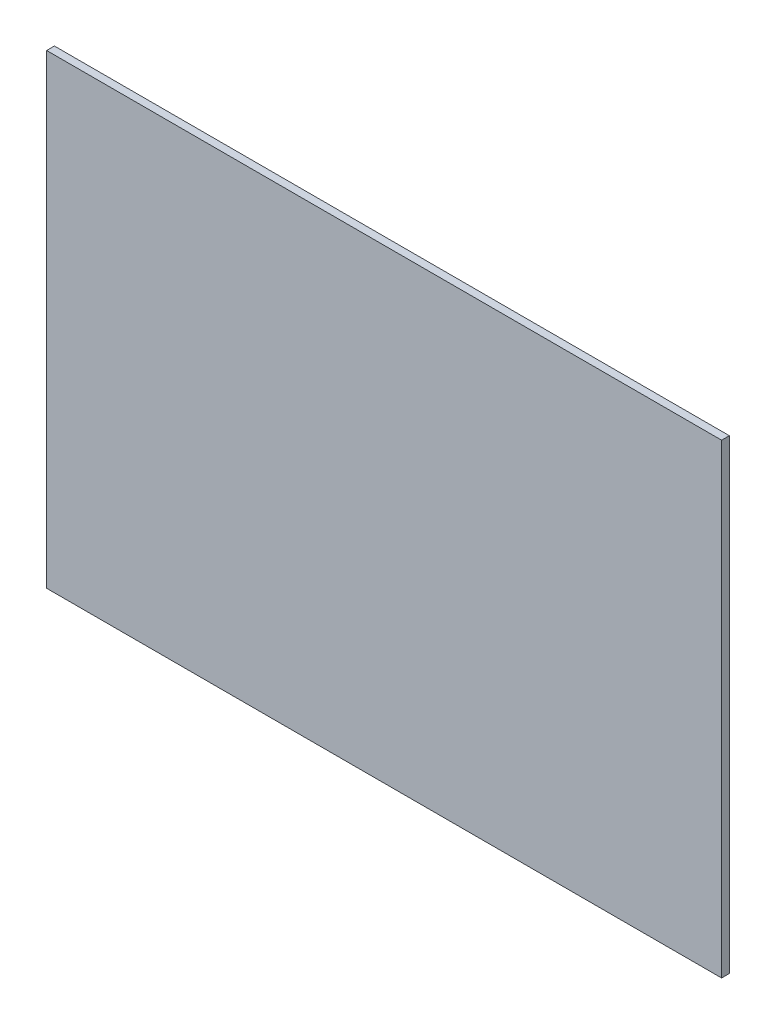
ISO-10303-21;
HEADER;
FILE_DESCRIPTION(('STEP AP214'),'2;1');
FILE_NAME('part.step','',(''),(''),'','','');
FILE_SCHEMA(('AUTOMOTIVE_DESIGN { 1 0 10303 214 1 1 1 1 }'));
ENDSEC;
DATA;
#1=APPLICATION_CONTEXT('core data for automotive mechanical design processes');
#2=APPLICATION_PROTOCOL_DEFINITION('international standard','automotive_design',2000,#1);
#3=PRODUCT_CONTEXT('',#1,'mechanical');
#4=PRODUCT('Part','Part','',(#3));
#5=PRODUCT_RELATED_PRODUCT_CATEGORY('part','',(#4));
#6=PRODUCT_DEFINITION_FORMATION('','',#4);
#7=PRODUCT_DEFINITION_CONTEXT('part definition',#1,'design');
#8=PRODUCT_DEFINITION('design','',#6,#7);
#9=PRODUCT_DEFINITION_SHAPE('','',#8);
#10=(LENGTH_UNIT() NAMED_UNIT(*) SI_UNIT(.MILLI.,.METRE.));
#11=(NAMED_UNIT(*) PLANE_ANGLE_UNIT() SI_UNIT($,.RADIAN.));
#12=(NAMED_UNIT(*) SI_UNIT($,.STERADIAN.) SOLID_ANGLE_UNIT());
#13=UNCERTAINTY_MEASURE_WITH_UNIT(LENGTH_MEASURE(1.E-05),#10,'distance_accuracy_value','');
#14=(GEOMETRIC_REPRESENTATION_CONTEXT(3) GLOBAL_UNCERTAINTY_ASSIGNED_CONTEXT((#13)) GLOBAL_UNIT_ASSIGNED_CONTEXT((#10,
#11,#12)) REPRESENTATION_CONTEXT('',''));
#15=CARTESIAN_POINT('',(0.,0.,0.));
#16=DIRECTION('',(0.,0.,1.));
#17=DIRECTION('',(1.,0.,0.));
#18=AXIS2_PLACEMENT_3D('',#15,#16,#17);
#19=CARTESIAN_POINT('',(-0.6025,0.,0.));
#20=DIRECTION('',(0.,0.,1.));
#21=DIRECTION('',(1.,0.,0.));
#22=AXIS2_PLACEMENT_3D('',#19,#20,#21);
#23=PLANE('',#22);
#24=DIRECTION('',(1.,0.,0.));
#25=VECTOR('',#24,1.);
#26=CARTESIAN_POINT('',(3.745,3.,0.));
#27=LINE('',#26,#25);
#28=CARTESIAN_POINT('',(3.745,3.,0.));
#29=VERTEX_POINT('',#28);
#30=CARTESIAN_POINT('',(-4.95,3.,0.));
#31=VERTEX_POINT('',#30);
#32=EDGE_CURVE('E78',#29,#31,#27,.F.);
#33=ORIENTED_EDGE('',*,*,#32,.F.);
#34=DIRECTION('',(0.,1.,0.));
#35=VECTOR('',#34,1.);
#36=CARTESIAN_POINT('',(3.745,-3.,0.));
#37=LINE('',#36,#35);
#38=CARTESIAN_POINT('',(3.745,-3.,0.));
#39=VERTEX_POINT('',#38);
#40=EDGE_CURVE('E54',#39,#29,#37,.T.);
#41=ORIENTED_EDGE('',*,*,#40,.F.);
#42=DIRECTION('',(1.,0.,0.));
#43=VECTOR('',#42,1.);
#44=CARTESIAN_POINT('',(-4.95,-3.,0.));
#45=LINE('',#44,#43);
#46=CARTESIAN_POINT('',(-4.95,-3.,0.));
#47=VERTEX_POINT('',#46);
#48=EDGE_CURVE('E56',#47,#39,#45,.T.);
#49=ORIENTED_EDGE('',*,*,#48,.F.);
#50=DIRECTION('',(0.,-1.,0.));
#51=VECTOR('',#50,1.);
#52=CARTESIAN_POINT('',(-4.95,3.,0.));
#53=LINE('',#52,#51);
#54=EDGE_CURVE('E19',#31,#47,#53,.T.);
#55=ORIENTED_EDGE('',*,*,#54,.F.);
#56=EDGE_LOOP('',(#33,#41,#49,#55));
#57=FACE_BOUND('',#56,.T.);
#58=ADVANCED_FACE('F16',(#57),#23,.F.);
#59=CARTESIAN_POINT('',(-4.95,3.,0.));
#60=DIRECTION('',(-1.,0.,0.));
#61=DIRECTION('',(0.,-1.,0.));
#62=AXIS2_PLACEMENT_3D('',#59,#60,#61);
#63=PLANE('',#62);
#64=DIRECTION('',(0.,1.,0.));
#65=VECTOR('',#64,1.);
#66=CARTESIAN_POINT('',(-4.95,0.,0.1));
#67=LINE('',#66,#65);
#68=CARTESIAN_POINT('',(-4.95,3.,0.1));
#69=VERTEX_POINT('',#68);
#70=CARTESIAN_POINT('',(-4.95,-3.,0.1));
#71=VERTEX_POINT('',#70);
#72=EDGE_CURVE('E82',#69,#71,#67,.F.);
#73=ORIENTED_EDGE('',*,*,#72,.F.);
#74=DIRECTION('',(0.,0.,1.));
#75=VECTOR('',#74,1.);
#76=CARTESIAN_POINT('',(-4.95,3.,0.));
#77=LINE('',#76,#75);
#78=EDGE_CURVE('E67',#31,#69,#77,.T.);
#79=ORIENTED_EDGE('',*,*,#78,.F.);
#80=ORIENTED_EDGE('',*,*,#54,.T.);
#81=DIRECTION('',(0.,0.,-1.));
#82=VECTOR('',#81,1.);
#83=CARTESIAN_POINT('',(-4.95,-3.,0.));
#84=LINE('',#83,#82);
#85=EDGE_CURVE('E62',#71,#47,#84,.T.);
#86=ORIENTED_EDGE('',*,*,#85,.F.);
#87=EDGE_LOOP('',(#73,#79,#80,#86));
#88=FACE_BOUND('',#87,.T.);
#89=ADVANCED_FACE('F64',(#88),#63,.T.);
#90=CARTESIAN_POINT('',(-4.95,-3.,0.));
#91=DIRECTION('',(0.,-1.,0.));
#92=DIRECTION('',(0.,0.,-1.));
#93=AXIS2_PLACEMENT_3D('',#90,#91,#92);
#94=PLANE('',#93);
#95=DIRECTION('',(1.,0.,0.));
#96=VECTOR('',#95,1.);
#97=CARTESIAN_POINT('',(-0.6025,-3.,0.1));
#98=LINE('',#97,#96);
#99=CARTESIAN_POINT('',(3.745,-3.,0.1));
#100=VERTEX_POINT('',#99);
#101=EDGE_CURVE('E71',#71,#100,#98,.T.);
#102=ORIENTED_EDGE('',*,*,#101,.F.);
#103=ORIENTED_EDGE('',*,*,#85,.T.);
#104=ORIENTED_EDGE('',*,*,#48,.T.);
#105=DIRECTION('',(0.,0.,1.));
#106=VECTOR('',#105,1.);
#107=CARTESIAN_POINT('',(3.745,-3.,0.));
#108=LINE('',#107,#106);
#109=EDGE_CURVE('E74',#100,#39,#108,.F.);
#110=ORIENTED_EDGE('',*,*,#109,.F.);
#111=EDGE_LOOP('',(#102,#103,#104,#110));
#112=FACE_BOUND('',#111,.T.);
#113=ADVANCED_FACE('F69',(#112),#94,.T.);
#114=CARTESIAN_POINT('',(3.745,-3.,0.));
#115=DIRECTION('',(1.,0.,0.));
#116=DIRECTION('',(0.,1.,0.));
#117=AXIS2_PLACEMENT_3D('',#114,#115,#116);
#118=PLANE('',#117);
#119=DIRECTION('',(0.,1.,0.));
#120=VECTOR('',#119,1.);
#121=CARTESIAN_POINT('',(3.745,0.,0.1));
#122=LINE('',#121,#120);
#123=CARTESIAN_POINT('',(3.745,3.,0.1));
#124=VERTEX_POINT('',#123);
#125=EDGE_CURVE('E25',#100,#124,#122,.T.);
#126=ORIENTED_EDGE('',*,*,#125,.F.);
#127=ORIENTED_EDGE('',*,*,#109,.T.);
#128=ORIENTED_EDGE('',*,*,#40,.T.);
#129=DIRECTION('',(0.,0.,1.));
#130=VECTOR('',#129,1.);
#131=CARTESIAN_POINT('',(3.745,3.,0.));
#132=LINE('',#131,#130);
#133=EDGE_CURVE('E34',#124,#29,#132,.F.);
#134=ORIENTED_EDGE('',*,*,#133,.F.);
#135=EDGE_LOOP('',(#126,#127,#128,#134));
#136=FACE_BOUND('',#135,.T.);
#137=ADVANCED_FACE('F88',(#136),#118,.T.);
#138=CARTESIAN_POINT('',(3.745,3.,0.));
#139=DIRECTION('',(0.,1.,0.));
#140=DIRECTION('',(0.,0.,1.));
#141=AXIS2_PLACEMENT_3D('',#138,#139,#140);
#142=PLANE('',#141);
#143=DIRECTION('',(1.,0.,0.));
#144=VECTOR('',#143,1.);
#145=CARTESIAN_POINT('',(-0.6025,3.,0.1));
#146=LINE('',#145,#144);
#147=EDGE_CURVE('E11',#124,#69,#146,.F.);
#148=ORIENTED_EDGE('',*,*,#147,.F.);
#149=ORIENTED_EDGE('',*,*,#133,.T.);
#150=ORIENTED_EDGE('',*,*,#32,.T.);
#151=ORIENTED_EDGE('',*,*,#78,.T.);
#152=EDGE_LOOP('',(#148,#149,#150,#151));
#153=FACE_BOUND('',#152,.T.);
#154=ADVANCED_FACE('F90',(#153),#142,.T.);
#155=CARTESIAN_POINT('',(-0.6025,0.,0.1));
#156=DIRECTION('',(0.,0.,1.));
#157=DIRECTION('',(1.,0.,0.));
#158=AXIS2_PLACEMENT_3D('',#155,#156,#157);
#159=PLANE('',#158);
#160=ORIENTED_EDGE('',*,*,#125,.T.);
#161=ORIENTED_EDGE('',*,*,#147,.T.);
#162=ORIENTED_EDGE('',*,*,#72,.T.);
#163=ORIENTED_EDGE('',*,*,#101,.T.);
#164=EDGE_LOOP('',(#160,#161,#162,#163));
#165=FACE_BOUND('',#164,.T.);
#166=ADVANCED_FACE('F87',(#165),#159,.T.);
#167=CLOSED_SHELL('',(#58,#89,#113,#137,#154,#166));
#168=MANIFOLD_SOLID_BREP('B1',#167);
#169=ADVANCED_BREP_SHAPE_REPRESENTATION('',(#18,#168),#14);
#170=SHAPE_DEFINITION_REPRESENTATION(#9,#169);
ENDSEC;
END-ISO-10303-21;
